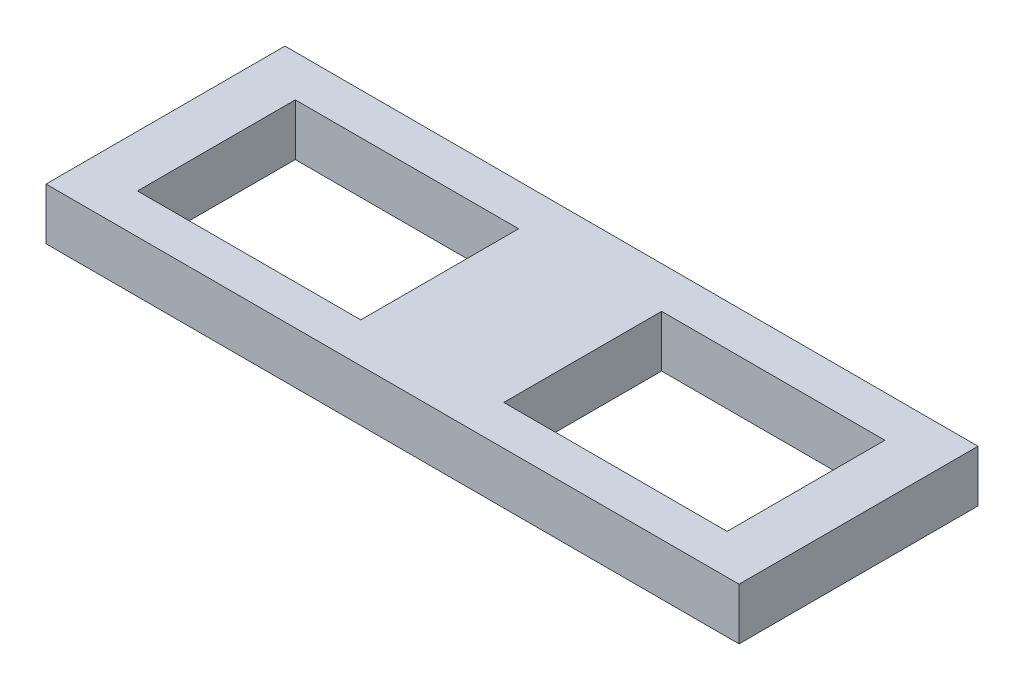
ISO-10303-21;
HEADER;
FILE_DESCRIPTION(('STEP AP214'),'2;1');
FILE_NAME('part.step','',(''),(''),'','','');
FILE_SCHEMA(('AUTOMOTIVE_DESIGN { 1 0 10303 214 1 1 1 1 }'));
ENDSEC;
DATA;
#1=APPLICATION_CONTEXT('core data for automotive mechanical design processes');
#2=APPLICATION_PROTOCOL_DEFINITION('international standard','automotive_design',2000,#1);
#3=PRODUCT_CONTEXT('',#1,'mechanical');
#4=PRODUCT('Part','Part','',(#3));
#5=PRODUCT_RELATED_PRODUCT_CATEGORY('part','',(#4));
#6=PRODUCT_DEFINITION_FORMATION('','',#4);
#7=PRODUCT_DEFINITION_CONTEXT('part definition',#1,'design');
#8=PRODUCT_DEFINITION('design','',#6,#7);
#9=PRODUCT_DEFINITION_SHAPE('','',#8);
#10=(LENGTH_UNIT() NAMED_UNIT(*) SI_UNIT(.MILLI.,.METRE.));
#11=(NAMED_UNIT(*) PLANE_ANGLE_UNIT() SI_UNIT($,.RADIAN.));
#12=(NAMED_UNIT(*) SI_UNIT($,.STERADIAN.) SOLID_ANGLE_UNIT());
#13=UNCERTAINTY_MEASURE_WITH_UNIT(LENGTH_MEASURE(1.E-05),#10,'distance_accuracy_value','');
#14=(GEOMETRIC_REPRESENTATION_CONTEXT(3) GLOBAL_UNCERTAINTY_ASSIGNED_CONTEXT((#13)) GLOBAL_UNIT_ASSIGNED_CONTEXT((#10,
#11,#12)) REPRESENTATION_CONTEXT('',''));
#15=CARTESIAN_POINT('',(0.,0.,0.));
#16=DIRECTION('',(0.,0.,1.));
#17=DIRECTION('',(1.,0.,0.));
#18=AXIS2_PLACEMENT_3D('',#15,#16,#17);
#19=CARTESIAN_POINT('',(0.,10.,0.));
#20=DIRECTION('',(0.,-1.,0.));
#21=DIRECTION('',(0.,0.,-1.));
#22=AXIS2_PLACEMENT_3D('',#19,#20,#21);
#23=PLANE('',#22);
#24=DIRECTION('',(0.,0.,1.));
#25=VECTOR('',#24,1.);
#26=CARTESIAN_POINT('',(10.,10.,-38.2));
#27=LINE('',#26,#25);
#28=CARTESIAN_POINT('',(10.,10.,-38.2));
#29=VERTEX_POINT('',#28);
#30=CARTESIAN_POINT('',(10.,10.,-7.68613608008906));
#31=VERTEX_POINT('',#30);
#32=EDGE_CURVE('E177',#29,#31,#27,.T.);
#33=ORIENTED_EDGE('',*,*,#32,.F.);
#34=DIRECTION('',(-1.,0.,0.));
#35=VECTOR('',#34,1.);
#36=CARTESIAN_POINT('',(10.,10.,-38.2));
#37=LINE('',#36,#35);
#38=CARTESIAN_POINT('',(53.1776714808052,10.,-38.2));
#39=VERTEX_POINT('',#38);
#40=EDGE_CURVE('E188',#39,#29,#37,.T.);
#41=ORIENTED_EDGE('',*,*,#40,.F.);
#42=DIRECTION('',(0.,0.,-1.));
#43=VECTOR('',#42,1.);
#44=CARTESIAN_POINT('',(53.1776714808052,10.,-38.2));
#45=LINE('',#44,#43);
#46=CARTESIAN_POINT('',(53.1776714808052,10.,-7.68613608008906));
#47=VERTEX_POINT('',#46);
#48=EDGE_CURVE('E184',#47,#39,#45,.T.);
#49=ORIENTED_EDGE('',*,*,#48,.F.);
#50=DIRECTION('',(1.,0.,0.));
#51=VECTOR('',#50,1.);
#52=CARTESIAN_POINT('',(10.,10.,-7.68613608008906));
#53=LINE('',#52,#51);
#54=EDGE_CURVE('E180',#31,#47,#53,.T.);
#55=ORIENTED_EDGE('',*,*,#54,.F.);
#56=EDGE_LOOP('',(#33,#41,#49,#55));
#57=FACE_BOUND('',#56,.T.);
#58=DIRECTION('',(0.,0.,1.));
#59=VECTOR('',#58,1.);
#60=CARTESIAN_POINT('',(0.,10.,0.));
#61=LINE('',#60,#59);
#62=CARTESIAN_POINT('',(0.,10.,-46.2));
#63=VERTEX_POINT('',#62);
#64=CARTESIAN_POINT('',(0.,10.,0.));
#65=VERTEX_POINT('',#64);
#66=EDGE_CURVE('E220',#63,#65,#61,.T.);
#67=ORIENTED_EDGE('',*,*,#66,.T.);
#68=DIRECTION('',(1.,0.,0.));
#69=VECTOR('',#68,1.);
#70=CARTESIAN_POINT('',(0.,10.,0.));
#71=LINE('',#70,#69);
#72=CARTESIAN_POINT('',(134.,10.,0.));
#73=VERTEX_POINT('',#72);
#74=EDGE_CURVE('E224',#65,#73,#71,.T.);
#75=ORIENTED_EDGE('',*,*,#74,.T.);
#76=DIRECTION('',(0.,0.,-1.));
#77=VECTOR('',#76,1.);
#78=CARTESIAN_POINT('',(134.,10.,0.));
#79=LINE('',#78,#77);
#80=CARTESIAN_POINT('',(134.,10.,-46.2));
#81=VERTEX_POINT('',#80);
#82=EDGE_CURVE('E228',#73,#81,#79,.T.);
#83=ORIENTED_EDGE('',*,*,#82,.T.);
#84=DIRECTION('',(-1.,0.,0.));
#85=VECTOR('',#84,1.);
#86=CARTESIAN_POINT('',(0.,10.,-46.2));
#87=LINE('',#86,#85);
#88=EDGE_CURVE('E231',#81,#63,#87,.T.);
#89=ORIENTED_EDGE('',*,*,#88,.T.);
#90=EDGE_LOOP('',(#67,#75,#83,#89));
#91=FACE_BOUND('',#90,.T.);
#92=DIRECTION('',(0.,0.,-1.));
#93=VECTOR('',#92,1.);
#94=CARTESIAN_POINT('',(124.,10.,-38.2));
#95=LINE('',#94,#93);
#96=CARTESIAN_POINT('',(124.,10.,-7.68613608008906));
#97=VERTEX_POINT('',#96);
#98=CARTESIAN_POINT('',(124.,10.,-38.2));
#99=VERTEX_POINT('',#98);
#100=EDGE_CURVE('E129',#97,#99,#95,.T.);
#101=ORIENTED_EDGE('',*,*,#100,.F.);
#102=DIRECTION('',(1.,0.,0.));
#103=VECTOR('',#102,1.);
#104=CARTESIAN_POINT('',(124.,10.,-7.68613608008906));
#105=LINE('',#104,#103);
#106=CARTESIAN_POINT('',(80.8223285191948,10.,-7.68613608008906));
#107=VERTEX_POINT('',#106);
#108=EDGE_CURVE('E155',#107,#97,#105,.T.);
#109=ORIENTED_EDGE('',*,*,#108,.F.);
#110=DIRECTION('',(0.,0.,1.));
#111=VECTOR('',#110,1.);
#112=CARTESIAN_POINT('',(80.8223285191948,10.,-38.2));
#113=LINE('',#112,#111);
#114=CARTESIAN_POINT('',(80.8223285191948,10.,-38.2));
#115=VERTEX_POINT('',#114);
#116=EDGE_CURVE('E151',#115,#107,#113,.T.);
#117=ORIENTED_EDGE('',*,*,#116,.F.);
#118=DIRECTION('',(-1.,0.,0.));
#119=VECTOR('',#118,1.);
#120=CARTESIAN_POINT('',(124.,10.,-38.2));
#121=LINE('',#120,#119);
#122=EDGE_CURVE('E138',#99,#115,#121,.T.);
#123=ORIENTED_EDGE('',*,*,#122,.F.);
#124=EDGE_LOOP('',(#101,#109,#117,#123));
#125=FACE_BOUND('',#124,.T.);
#126=ADVANCED_FACE('F39',(#57,#91,#125),#23,.F.);
#127=CARTESIAN_POINT('',(0.,0.,0.));
#128=DIRECTION('',(0.,-1.,0.));
#129=DIRECTION('',(0.,0.,-1.));
#130=AXIS2_PLACEMENT_3D('',#127,#128,#129);
#131=PLANE('',#130);
#132=DIRECTION('',(0.,0.,1.));
#133=VECTOR('',#132,1.);
#134=CARTESIAN_POINT('',(0.,0.,0.));
#135=LINE('',#134,#133);
#136=CARTESIAN_POINT('',(0.,0.,-46.2));
#137=VERTEX_POINT('',#136);
#138=CARTESIAN_POINT('',(0.,0.,0.));
#139=VERTEX_POINT('',#138);
#140=EDGE_CURVE('E219',#137,#139,#135,.T.);
#141=ORIENTED_EDGE('',*,*,#140,.F.);
#142=DIRECTION('',(-1.,0.,0.));
#143=VECTOR('',#142,1.);
#144=CARTESIAN_POINT('',(0.,0.,-46.2));
#145=LINE('',#144,#143);
#146=CARTESIAN_POINT('',(134.,0.,-46.2));
#147=VERTEX_POINT('',#146);
#148=EDGE_CURVE('E225',#147,#137,#145,.T.);
#149=ORIENTED_EDGE('',*,*,#148,.F.);
#150=DIRECTION('',(0.,0.,-1.));
#151=VECTOR('',#150,1.);
#152=CARTESIAN_POINT('',(134.,0.,0.));
#153=LINE('',#152,#151);
#154=CARTESIAN_POINT('',(134.,0.,0.));
#155=VERTEX_POINT('',#154);
#156=EDGE_CURVE('E241',#155,#147,#153,.T.);
#157=ORIENTED_EDGE('',*,*,#156,.F.);
#158=DIRECTION('',(1.,0.,0.));
#159=VECTOR('',#158,1.);
#160=CARTESIAN_POINT('',(0.,0.,0.));
#161=LINE('',#160,#159);
#162=EDGE_CURVE('E238',#139,#155,#161,.T.);
#163=ORIENTED_EDGE('',*,*,#162,.F.);
#164=EDGE_LOOP('',(#141,#149,#157,#163));
#165=FACE_BOUND('',#164,.T.);
#166=DIRECTION('',(-1.,0.,0.));
#167=VECTOR('',#166,1.);
#168=CARTESIAN_POINT('',(10.,0.,-38.2));
#169=LINE('',#168,#167);
#170=CARTESIAN_POINT('',(53.1776714808052,0.,-38.2));
#171=VERTEX_POINT('',#170);
#172=CARTESIAN_POINT('',(10.,0.,-38.2));
#173=VERTEX_POINT('',#172);
#174=EDGE_CURVE('E181',#171,#173,#169,.T.);
#175=ORIENTED_EDGE('',*,*,#174,.T.);
#176=DIRECTION('',(0.,0.,1.));
#177=VECTOR('',#176,1.);
#178=CARTESIAN_POINT('',(10.,0.,-38.2));
#179=LINE('',#178,#177);
#180=CARTESIAN_POINT('',(10.,0.,-7.68613608008906));
#181=VERTEX_POINT('',#180);
#182=EDGE_CURVE('E147',#173,#181,#179,.T.);
#183=ORIENTED_EDGE('',*,*,#182,.T.);
#184=DIRECTION('',(1.,0.,0.));
#185=VECTOR('',#184,1.);
#186=CARTESIAN_POINT('',(10.,0.,-7.68613608008906));
#187=LINE('',#186,#185);
#188=CARTESIAN_POINT('',(53.1776714808052,0.,-7.68613608008906));
#189=VERTEX_POINT('',#188);
#190=EDGE_CURVE('E195',#181,#189,#187,.T.);
#191=ORIENTED_EDGE('',*,*,#190,.T.);
#192=DIRECTION('',(0.,0.,-1.));
#193=VECTOR('',#192,1.);
#194=CARTESIAN_POINT('',(53.1776714808052,0.,-38.2));
#195=LINE('',#194,#193);
#196=EDGE_CURVE('E199',#189,#171,#195,.T.);
#197=ORIENTED_EDGE('',*,*,#196,.T.);
#198=EDGE_LOOP('',(#175,#183,#191,#197));
#199=FACE_BOUND('',#198,.T.);
#200=DIRECTION('',(1.,0.,0.));
#201=VECTOR('',#200,1.);
#202=CARTESIAN_POINT('',(124.,0.,-7.68613608008906));
#203=LINE('',#202,#201);
#204=CARTESIAN_POINT('',(80.8223285191948,0.,-7.68613608008906));
#205=VERTEX_POINT('',#204);
#206=CARTESIAN_POINT('',(124.,0.,-7.68613608008906));
#207=VERTEX_POINT('',#206);
#208=EDGE_CURVE('E139',#205,#207,#203,.T.);
#209=ORIENTED_EDGE('',*,*,#208,.T.);
#210=DIRECTION('',(0.,0.,-1.));
#211=VECTOR('',#210,1.);
#212=CARTESIAN_POINT('',(124.,0.,-38.2));
#213=LINE('',#212,#211);
#214=CARTESIAN_POINT('',(124.,0.,-38.2));
#215=VERTEX_POINT('',#214);
#216=EDGE_CURVE('E63',#207,#215,#213,.T.);
#217=ORIENTED_EDGE('',*,*,#216,.T.);
#218=DIRECTION('',(-1.,0.,0.));
#219=VECTOR('',#218,1.);
#220=CARTESIAN_POINT('',(124.,0.,-38.2));
#221=LINE('',#220,#219);
#222=CARTESIAN_POINT('',(80.8223285191948,0.,-38.2));
#223=VERTEX_POINT('',#222);
#224=EDGE_CURVE('E145',#215,#223,#221,.T.);
#225=ORIENTED_EDGE('',*,*,#224,.T.);
#226=DIRECTION('',(0.,0.,1.));
#227=VECTOR('',#226,1.);
#228=CARTESIAN_POINT('',(80.8223285191948,0.,-38.2));
#229=LINE('',#228,#227);
#230=EDGE_CURVE('E164',#223,#205,#229,.T.);
#231=ORIENTED_EDGE('',*,*,#230,.T.);
#232=EDGE_LOOP('',(#209,#217,#225,#231));
#233=FACE_BOUND('',#232,.T.);
#234=ADVANCED_FACE('F264',(#165,#199,#233),#131,.T.);
#235=CARTESIAN_POINT('',(0.,10.,0.));
#236=DIRECTION('',(1.,0.,0.));
#237=DIRECTION('',(0.,0.,-1.));
#238=AXIS2_PLACEMENT_3D('',#235,#236,#237);
#239=PLANE('',#238);
#240=ORIENTED_EDGE('',*,*,#140,.T.);
#241=DIRECTION('',(0.,-1.,0.));
#242=VECTOR('',#241,1.);
#243=CARTESIAN_POINT('',(0.,10.,0.));
#244=LINE('',#243,#242);
#245=EDGE_CURVE('E11',#65,#139,#244,.T.);
#246=ORIENTED_EDGE('',*,*,#245,.F.);
#247=ORIENTED_EDGE('',*,*,#66,.F.);
#248=DIRECTION('',(0.,-1.,0.));
#249=VECTOR('',#248,1.);
#250=CARTESIAN_POINT('',(0.,10.,-46.2));
#251=LINE('',#250,#249);
#252=EDGE_CURVE('E234',#63,#137,#251,.T.);
#253=ORIENTED_EDGE('',*,*,#252,.T.);
#254=EDGE_LOOP('',(#240,#246,#247,#253));
#255=FACE_BOUND('',#254,.T.);
#256=ADVANCED_FACE('F41',(#255),#239,.F.);
#257=CARTESIAN_POINT('',(0.,10.,0.));
#258=DIRECTION('',(0.,0.,-1.));
#259=DIRECTION('',(-1.,0.,0.));
#260=AXIS2_PLACEMENT_3D('',#257,#258,#259);
#261=PLANE('',#260);
#262=ORIENTED_EDGE('',*,*,#162,.T.);
#263=DIRECTION('',(0.,-1.,0.));
#264=VECTOR('',#263,1.);
#265=CARTESIAN_POINT('',(134.,10.,0.));
#266=LINE('',#265,#264);
#267=EDGE_CURVE('E48',#73,#155,#266,.T.);
#268=ORIENTED_EDGE('',*,*,#267,.F.);
#269=ORIENTED_EDGE('',*,*,#74,.F.);
#270=ORIENTED_EDGE('',*,*,#245,.T.);
#271=EDGE_LOOP('',(#262,#268,#269,#270));
#272=FACE_BOUND('',#271,.T.);
#273=ADVANCED_FACE('F274',(#272),#261,.F.);
#274=CARTESIAN_POINT('',(134.,10.,0.));
#275=DIRECTION('',(-1.,0.,0.));
#276=DIRECTION('',(0.,0.,1.));
#277=AXIS2_PLACEMENT_3D('',#274,#275,#276);
#278=PLANE('',#277);
#279=ORIENTED_EDGE('',*,*,#156,.T.);
#280=DIRECTION('',(0.,-1.,0.));
#281=VECTOR('',#280,1.);
#282=CARTESIAN_POINT('',(134.,10.,-46.2));
#283=LINE('',#282,#281);
#284=EDGE_CURVE('E249',#81,#147,#283,.T.);
#285=ORIENTED_EDGE('',*,*,#284,.F.);
#286=ORIENTED_EDGE('',*,*,#82,.F.);
#287=ORIENTED_EDGE('',*,*,#267,.T.);
#288=EDGE_LOOP('',(#279,#285,#286,#287));
#289=FACE_BOUND('',#288,.T.);
#290=ADVANCED_FACE('F258',(#289),#278,.F.);
#291=CARTESIAN_POINT('',(0.,10.,-46.2));
#292=DIRECTION('',(0.,0.,1.));
#293=DIRECTION('',(1.,0.,0.));
#294=AXIS2_PLACEMENT_3D('',#291,#292,#293);
#295=PLANE('',#294);
#296=ORIENTED_EDGE('',*,*,#148,.T.);
#297=ORIENTED_EDGE('',*,*,#252,.F.);
#298=ORIENTED_EDGE('',*,*,#88,.F.);
#299=ORIENTED_EDGE('',*,*,#284,.T.);
#300=EDGE_LOOP('',(#296,#297,#298,#299));
#301=FACE_BOUND('',#300,.T.);
#302=ADVANCED_FACE('F268',(#301),#295,.F.);
#303=CARTESIAN_POINT('',(10.,10.,-38.2));
#304=DIRECTION('',(1.,0.,0.));
#305=DIRECTION('',(0.,0.,-1.));
#306=AXIS2_PLACEMENT_3D('',#303,#304,#305);
#307=PLANE('',#306);
#308=ORIENTED_EDGE('',*,*,#182,.F.);
#309=DIRECTION('',(0.,-1.,0.));
#310=VECTOR('',#309,1.);
#311=CARTESIAN_POINT('',(10.,10.,-38.2));
#312=LINE('',#311,#310);
#313=EDGE_CURVE('E191',#29,#173,#312,.T.);
#314=ORIENTED_EDGE('',*,*,#313,.F.);
#315=ORIENTED_EDGE('',*,*,#32,.T.);
#316=DIRECTION('',(0.,-1.,0.));
#317=VECTOR('',#316,1.);
#318=CARTESIAN_POINT('',(10.,10.,-7.68613608008906));
#319=LINE('',#318,#317);
#320=EDGE_CURVE('E215',#31,#181,#319,.T.);
#321=ORIENTED_EDGE('',*,*,#320,.T.);
#322=EDGE_LOOP('',(#308,#314,#315,#321));
#323=FACE_BOUND('',#322,.T.);
#324=ADVANCED_FACE('F290',(#323),#307,.T.);
#325=CARTESIAN_POINT('',(10.,10.,-7.68613608008906));
#326=DIRECTION('',(0.,0.,-1.));
#327=DIRECTION('',(-1.,0.,0.));
#328=AXIS2_PLACEMENT_3D('',#325,#326,#327);
#329=PLANE('',#328);
#330=ORIENTED_EDGE('',*,*,#190,.F.);
#331=ORIENTED_EDGE('',*,*,#320,.F.);
#332=ORIENTED_EDGE('',*,*,#54,.T.);
#333=DIRECTION('',(0.,-1.,0.));
#334=VECTOR('',#333,1.);
#335=CARTESIAN_POINT('',(53.1776714808052,10.,-7.68613608008906));
#336=LINE('',#335,#334);
#337=EDGE_CURVE('E212',#47,#189,#336,.T.);
#338=ORIENTED_EDGE('',*,*,#337,.T.);
#339=EDGE_LOOP('',(#330,#331,#332,#338));
#340=FACE_BOUND('',#339,.T.);
#341=ADVANCED_FACE('F297',(#340),#329,.T.);
#342=CARTESIAN_POINT('',(53.1776714808052,10.,-38.2));
#343=DIRECTION('',(-1.,0.,0.));
#344=DIRECTION('',(0.,0.,1.));
#345=AXIS2_PLACEMENT_3D('',#342,#343,#344);
#346=PLANE('',#345);
#347=ORIENTED_EDGE('',*,*,#196,.F.);
#348=ORIENTED_EDGE('',*,*,#337,.F.);
#349=ORIENTED_EDGE('',*,*,#48,.T.);
#350=DIRECTION('',(0.,-1.,0.));
#351=VECTOR('',#350,1.);
#352=CARTESIAN_POINT('',(53.1776714808052,10.,-38.2));
#353=LINE('',#352,#351);
#354=EDGE_CURVE('E209',#39,#171,#353,.T.);
#355=ORIENTED_EDGE('',*,*,#354,.T.);
#356=EDGE_LOOP('',(#347,#348,#349,#355));
#357=FACE_BOUND('',#356,.T.);
#358=ADVANCED_FACE('F302',(#357),#346,.T.);
#359=CARTESIAN_POINT('',(10.,10.,-38.2));
#360=DIRECTION('',(0.,0.,1.));
#361=DIRECTION('',(1.,0.,0.));
#362=AXIS2_PLACEMENT_3D('',#359,#360,#361);
#363=PLANE('',#362);
#364=ORIENTED_EDGE('',*,*,#174,.F.);
#365=ORIENTED_EDGE('',*,*,#354,.F.);
#366=ORIENTED_EDGE('',*,*,#40,.T.);
#367=ORIENTED_EDGE('',*,*,#313,.T.);
#368=EDGE_LOOP('',(#364,#365,#366,#367));
#369=FACE_BOUND('',#368,.T.);
#370=ADVANCED_FACE('F308',(#369),#363,.T.);
#371=CARTESIAN_POINT('',(124.,10.,-38.2));
#372=DIRECTION('',(-1.,0.,0.));
#373=DIRECTION('',(0.,0.,1.));
#374=AXIS2_PLACEMENT_3D('',#371,#372,#373);
#375=PLANE('',#374);
#376=ORIENTED_EDGE('',*,*,#216,.F.);
#377=DIRECTION('',(0.,-1.,0.));
#378=VECTOR('',#377,1.);
#379=CARTESIAN_POINT('',(124.,10.,-7.68613608008906));
#380=LINE('',#379,#378);
#381=EDGE_CURVE('E133',#97,#207,#380,.T.);
#382=ORIENTED_EDGE('',*,*,#381,.F.);
#383=ORIENTED_EDGE('',*,*,#100,.T.);
#384=DIRECTION('',(0.,-1.,0.));
#385=VECTOR('',#384,1.);
#386=CARTESIAN_POINT('',(124.,10.,-38.2));
#387=LINE('',#386,#385);
#388=EDGE_CURVE('E132',#99,#215,#387,.T.);
#389=ORIENTED_EDGE('',*,*,#388,.T.);
#390=EDGE_LOOP('',(#376,#382,#383,#389));
#391=FACE_BOUND('',#390,.T.);
#392=ADVANCED_FACE('F131',(#391),#375,.T.);
#393=CARTESIAN_POINT('',(124.,10.,-38.2));
#394=DIRECTION('',(0.,0.,1.));
#395=DIRECTION('',(1.,0.,0.));
#396=AXIS2_PLACEMENT_3D('',#393,#394,#395);
#397=PLANE('',#396);
#398=ORIENTED_EDGE('',*,*,#224,.F.);
#399=ORIENTED_EDGE('',*,*,#388,.F.);
#400=ORIENTED_EDGE('',*,*,#122,.T.);
#401=DIRECTION('',(0.,-1.,0.));
#402=VECTOR('',#401,1.);
#403=CARTESIAN_POINT('',(80.8223285191948,10.,-38.2));
#404=LINE('',#403,#402);
#405=EDGE_CURVE('E148',#115,#223,#404,.T.);
#406=ORIENTED_EDGE('',*,*,#405,.T.);
#407=EDGE_LOOP('',(#398,#399,#400,#406));
#408=FACE_BOUND('',#407,.T.);
#409=ADVANCED_FACE('F142',(#408),#397,.T.);
#410=CARTESIAN_POINT('',(80.8223285191948,10.,-38.2));
#411=DIRECTION('',(1.,0.,0.));
#412=DIRECTION('',(0.,0.,-1.));
#413=AXIS2_PLACEMENT_3D('',#410,#411,#412);
#414=PLANE('',#413);
#415=ORIENTED_EDGE('',*,*,#230,.F.);
#416=ORIENTED_EDGE('',*,*,#405,.F.);
#417=ORIENTED_EDGE('',*,*,#116,.T.);
#418=DIRECTION('',(0.,-1.,0.));
#419=VECTOR('',#418,1.);
#420=CARTESIAN_POINT('',(80.8223285191948,10.,-7.68613608008906));
#421=LINE('',#420,#419);
#422=EDGE_CURVE('E55',#107,#205,#421,.T.);
#423=ORIENTED_EDGE('',*,*,#422,.T.);
#424=EDGE_LOOP('',(#415,#416,#417,#423));
#425=FACE_BOUND('',#424,.T.);
#426=ADVANCED_FACE('F327',(#425),#414,.T.);
#427=CARTESIAN_POINT('',(124.,10.,-7.68613608008906));
#428=DIRECTION('',(0.,0.,-1.));
#429=DIRECTION('',(-1.,0.,0.));
#430=AXIS2_PLACEMENT_3D('',#427,#428,#429);
#431=PLANE('',#430);
#432=ORIENTED_EDGE('',*,*,#208,.F.);
#433=ORIENTED_EDGE('',*,*,#422,.F.);
#434=ORIENTED_EDGE('',*,*,#108,.T.);
#435=ORIENTED_EDGE('',*,*,#381,.T.);
#436=EDGE_LOOP('',(#432,#433,#434,#435));
#437=FACE_BOUND('',#436,.T.);
#438=ADVANCED_FACE('F330',(#437),#431,.T.);
#439=CLOSED_SHELL('',(#126,#234,#256,#273,#290,#302,#324,#341,#358,#370,#392,#409,#426,#438));
#440=MANIFOLD_SOLID_BREP('B2',#439);
#441=ADVANCED_BREP_SHAPE_REPRESENTATION('',(#18,#440),#14);
#442=SHAPE_DEFINITION_REPRESENTATION(#9,#441);
ENDSEC;
END-ISO-10303-21;
